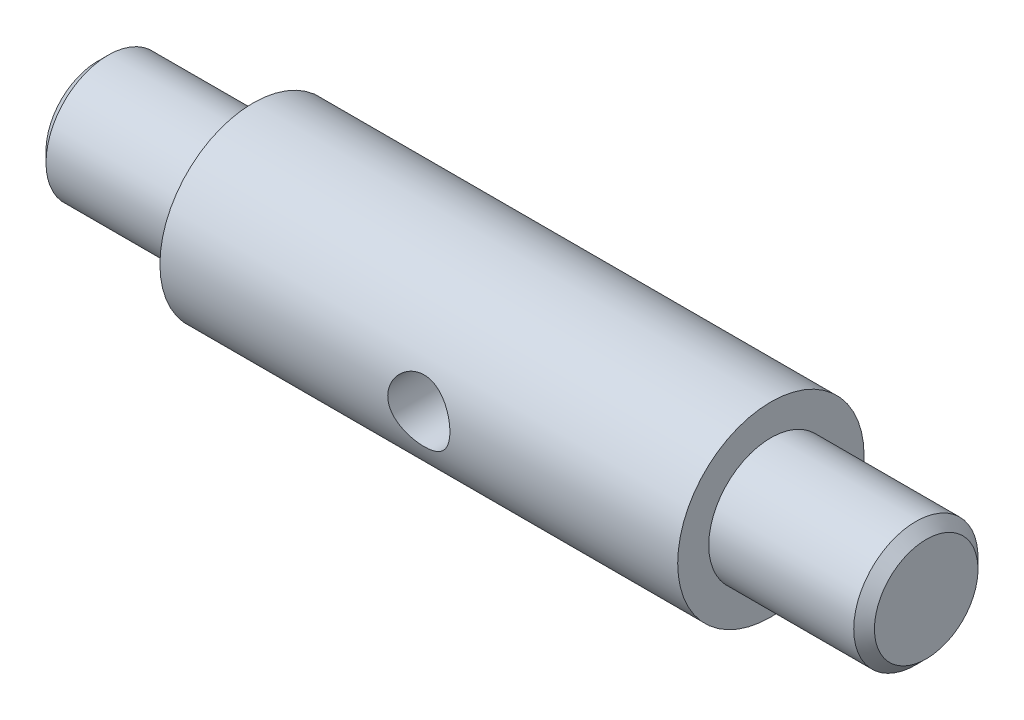
ISO-10303-21;
HEADER;
FILE_DESCRIPTION(('STEP AP214'),'2;1');
FILE_NAME('part.step','',(''),(''),'','','');
FILE_SCHEMA(('AUTOMOTIVE_DESIGN { 1 0 10303 214 1 1 1 1 }'));
ENDSEC;
DATA;
#1=APPLICATION_CONTEXT('core data for automotive mechanical design processes');
#2=APPLICATION_PROTOCOL_DEFINITION('international standard','automotive_design',2000,#1);
#3=PRODUCT_CONTEXT('',#1,'mechanical');
#4=PRODUCT('Part','Part','',(#3));
#5=PRODUCT_RELATED_PRODUCT_CATEGORY('part','',(#4));
#6=PRODUCT_DEFINITION_FORMATION('','',#4);
#7=PRODUCT_DEFINITION_CONTEXT('part definition',#1,'design');
#8=PRODUCT_DEFINITION('design','',#6,#7);
#9=PRODUCT_DEFINITION_SHAPE('','',#8);
#10=(LENGTH_UNIT() NAMED_UNIT(*) SI_UNIT(.MILLI.,.METRE.));
#11=(NAMED_UNIT(*) PLANE_ANGLE_UNIT() SI_UNIT($,.RADIAN.));
#12=(NAMED_UNIT(*) SI_UNIT($,.STERADIAN.) SOLID_ANGLE_UNIT());
#13=UNCERTAINTY_MEASURE_WITH_UNIT(LENGTH_MEASURE(1.E-05),#10,'distance_accuracy_value','');
#14=(GEOMETRIC_REPRESENTATION_CONTEXT(3) GLOBAL_UNCERTAINTY_ASSIGNED_CONTEXT((#13)) GLOBAL_UNIT_ASSIGNED_CONTEXT((#10,
#11,#12)) REPRESENTATION_CONTEXT('',''));
#15=CARTESIAN_POINT('',(0.,0.,0.));
#16=DIRECTION('',(0.,0.,1.));
#17=DIRECTION('',(1.,0.,0.));
#18=AXIS2_PLACEMENT_3D('',#15,#16,#17);
#19=CARTESIAN_POINT('',(40.,0.,-9.));
#20=DIRECTION('',(0.,0.,1.));
#21=DIRECTION('',(1.,0.,0.));
#22=AXIS2_PLACEMENT_3D('',#19,#20,#21);
#23=CYLINDRICAL_SURFACE('',#22,3.);
#24=CARTESIAN_POINT('',(43.,0.,9.));
#25=CARTESIAN_POINT('',(43.0000007611949,-0.163690088660169,9.00000045902832));
#26=CARTESIAN_POINT('',(42.9865592016184,-0.327375583615649,8.99549308522634));
#27=CARTESIAN_POINT('',(42.9333126735484,-0.649925282618916,8.97795630609842));
#28=CARTESIAN_POINT('',(42.8935049681532,-0.808788984356453,8.96492601606457));
#29=CARTESIAN_POINT('',(42.7890422698479,-1.11699836850533,8.93175923719327));
#30=CARTESIAN_POINT('',(42.7244288126222,-1.2663594776581,8.91163463192559));
#31=CARTESIAN_POINT('',(42.572376481485,-1.55212481041597,8.86633337152025));
#32=CARTESIAN_POINT('',(42.4849331049922,-1.68852647087612,8.84115572003333));
#33=CARTESIAN_POINT('',(42.2865225854237,-1.9492250250668,8.78742283329015));
#34=CARTESIAN_POINT('',(42.1749062972185,-2.07301110089493,8.75878669391354));
#35=CARTESIAN_POINT('',(41.9326985358803,-2.30049807810625,8.70180944349364));
#36=CARTESIAN_POINT('',(41.8021028952145,-2.40419455646839,8.67346839871647));
#37=CARTESIAN_POINT('',(41.5210446544106,-2.59147482668358,8.61939997431821));
#38=CARTESIAN_POINT('',(41.3701187808036,-2.67439457466309,8.59377117827064));
#39=CARTESIAN_POINT('',(41.0554717166244,-2.81345662163316,8.54925916255803));
#40=CARTESIAN_POINT('',(40.8917544485118,-2.8696070921603,8.53037388482236));
#41=CARTESIAN_POINT('',(40.5619803355099,-2.95162038452749,8.50233909808131));
#42=CARTESIAN_POINT('',(40.3961883745328,-2.97844034481531,8.49288287308833));
#43=CARTESIAN_POINT('',(40.0622087375324,-3.00402337000343,8.48386969888522));
#44=CARTESIAN_POINT('',(39.8940218178724,-3.00279510481416,8.48430969068189));
#45=CARTESIAN_POINT('',(39.5681901086679,-2.97305971111026,8.4947704502454));
#46=CARTESIAN_POINT('',(39.4104147912429,-2.94580173950099,8.50435247602598));
#47=CARTESIAN_POINT('',(39.1018197411795,-2.86681848854825,8.53129973173652));
#48=CARTESIAN_POINT('',(38.9510008436948,-2.81509027977562,8.54866589352322));
#49=CARTESIAN_POINT('',(38.6577617512256,-2.68781717418063,8.58953733393746));
#50=CARTESIAN_POINT('',(38.5155159235914,-2.61190214612179,8.61313697379351));
#51=CARTESIAN_POINT('',(38.2453872751608,-2.43866731890942,8.66377675727179));
#52=CARTESIAN_POINT('',(38.1175086191999,-2.34134133709202,8.6908178937139));
#53=CARTESIAN_POINT('',(37.8727252055177,-2.12204799804671,8.74701987503222));
#54=CARTESIAN_POINT('',(37.7567419164728,-1.99905945022894,8.77621768064528));
#55=CARTESIAN_POINT('',(37.5468062000098,-1.73501870991019,8.83220815161109));
#56=CARTESIAN_POINT('',(37.4528558855065,-1.59396478698245,8.85900058614201));
#57=CARTESIAN_POINT('',(37.2889110992948,-1.29584283913881,8.9075132381338));
#58=CARTESIAN_POINT('',(37.2191635259778,-1.13862982924901,8.92918050024117));
#59=CARTESIAN_POINT('',(37.1073904781329,-0.813807250093527,8.96461701433304));
#60=CARTESIAN_POINT('',(37.0653553737297,-0.646201314464865,8.97838900964637));
#61=CARTESIAN_POINT('',(37.0118330019329,-0.313151488587915,8.99602881214321));
#62=CARTESIAN_POINT('',(36.9991005724817,-0.147928799594541,9.00030005501183));
#63=CARTESIAN_POINT('',(37.0009980207954,0.182325209880711,8.99966708084482));
#64=CARTESIAN_POINT('',(37.0156232799396,0.34735655795895,8.99476441258086));
#65=CARTESIAN_POINT('',(37.0708357232079,0.667559598912766,8.97660074151312));
#66=CARTESIAN_POINT('',(37.1106586181485,0.822878420504531,8.96358596133576));
#67=CARTESIAN_POINT('',(37.2141803334002,1.12456787573872,8.93075540490209));
#68=CARTESIAN_POINT('',(37.2778821984034,1.27093736552582,8.91093876140025));
#69=CARTESIAN_POINT('',(37.4292112955224,1.55486488917982,8.86586793861869));
#70=CARTESIAN_POINT('',(37.5174237798495,1.69208987765144,8.84048444267358));
#71=CARTESIAN_POINT('',(37.7145824500404,1.95019449040676,8.78715761748787));
#72=CARTESIAN_POINT('',(37.8235349680953,2.07106910338673,8.75921350781482));
#73=CARTESIAN_POINT('',(38.0649362530198,2.2987575234189,8.70230543941334));
#74=CARTESIAN_POINT('',(38.1982276807806,2.40468290773731,8.67335283262283));
#75=CARTESIAN_POINT('',(38.4813147034327,2.59277256697072,8.61899919884126));
#76=CARTESIAN_POINT('',(38.6311104359022,2.67493664379304,8.59359820146006));
#77=CARTESIAN_POINT('',(38.9430190458697,2.81279079124908,8.5494717537415));
#78=CARTESIAN_POINT('',(39.1051062375063,2.86853439649506,8.53073282378936));
#79=CARTESIAN_POINT('',(39.4371359501324,2.95168400027807,8.50232496919348));
#80=CARTESIAN_POINT('',(39.607074896213,2.97910276486182,8.49265195870917));
#81=CARTESIAN_POINT('',(39.9405912881227,3.00382884743203,8.48393576622531));
#82=CARTESIAN_POINT('',(40.1040470208605,3.0026107719252,8.48437200772245));
#83=CARTESIAN_POINT('',(40.4282952247662,2.97372688034608,8.49453809471601));
#84=CARTESIAN_POINT('',(40.5890878538653,2.94606263837576,8.50426738708084));
#85=CARTESIAN_POINT('',(40.9004069890074,2.86611543938804,8.53153572914674));
#86=CARTESIAN_POINT('',(41.0510704750135,2.81431003804654,8.54892294067432));
#87=CARTESIAN_POINT('',(41.3416822208148,2.68793809727924,8.58949196455405));
#88=CARTESIAN_POINT('',(41.481628093564,2.61336650566142,8.61267506290179));
#89=CARTESIAN_POINT('',(41.7534510097687,2.43978207775029,8.66348487678138));
#90=CARTESIAN_POINT('',(41.8847095056952,2.33984472829374,8.69126134926411));
#91=CARTESIAN_POINT('',(42.1290694401526,2.11992864940694,8.74750068849758));
#92=CARTESIAN_POINT('',(42.2421657270642,1.99994425335444,8.77596374737116));
#93=CARTESIAN_POINT('',(42.4514332368675,1.73772467076207,8.83170091576632));
#94=CARTESIAN_POINT('',(42.546773043253,1.59480454049919,8.85888545403769));
#95=CARTESIAN_POINT('',(42.7119712865519,1.29407207221988,8.90777973517835));
#96=CARTESIAN_POINT('',(42.7818362377661,1.13626355439705,8.92949087723789));
#97=CARTESIAN_POINT('',(42.891164897466,0.817480941602932,8.96416545205625));
#98=CARTESIAN_POINT('',(42.9318473987901,0.656963273029229,8.97747637267567));
#99=CARTESIAN_POINT('',(42.9862608420314,0.330961248030742,8.99539221192665));
#100=CARTESIAN_POINT('',(42.9999992304896,0.16547827670624,8.99999953595714));
#101=CARTESIAN_POINT('',(43.,0.,9.));
#102=B_SPLINE_CURVE_WITH_KNOTS('',3,(#24,#25,#26,#27,#28,#29,#30,#31,#32,#33,#34,#35,#36,#37,
#38,#39,#40,#41,#42,#43,#44,#45,#46,#47,#48,#49,#50,#51,#52,#53,#54,#55,#56,#57,#58,#59,#60,#61,
#62,#63,#64,#65,#66,#67,#68,#69,#70,#71,#72,#73,#74,#75,#76,#77,#78,#79,#80,#81,#82,#83,#84,#85,
#86,#87,#88,#89,#90,#91,#92,#93,#94,#95,#96,#97,#98,#99,#100,#101),.UNSPECIFIED.,.T.,.F.,(4,2,2,
2,2,2,2,2,2,2,2,2,2,2,2,2,2,2,2,2,2,2,2,2,2,2,2,2,2,2,2,2,2,2,2,2,2,2,4),(0.,0.490461318078033,
0.980973555802562,1.47066801861082,1.9604591333973,2.46554052848268,2.97073299862591,
3.49045154470411,4.010011340785,4.51205777225521,5.01394901962457,5.49290479653841,
5.97191792566446,6.45864513465392,6.94551307674622,7.45779917434101,7.97013437899855,
8.48755216951072,9.00479006631625,9.49960749525509,9.9943413949253,10.4747447393464,
10.9552093585231,11.4483119953121,11.9415654246567,12.4572306864226,12.9729002470499,
13.4875204148031,14.0019085411752,14.4898699819277,14.9778023805413,15.4564676124125,
15.9352391452793,16.4349020007541,16.9347063337134,17.453989825053,17.9731404345737,
18.4690967512144,18.9649159811442),.UNSPECIFIED.);
#103=CARTESIAN_POINT('',(43.,0.,9.));
#104=VERTEX_POINT('',#103);
#105=EDGE_CURVE('E86',#104,#104,#102,.T.);
#106=ORIENTED_EDGE('',*,*,#105,.F.);
#107=EDGE_LOOP('',(#106));
#108=FACE_BOUND('',#107,.T.);
#109=CARTESIAN_POINT('',(40.,0.,0.));
#110=DIRECTION('',(0.707106781186547,0.,0.707106781186547));
#111=DIRECTION('',(-0.707106781186547,0.,0.707106781186547));
#112=AXIS2_PLACEMENT_3D('',#109,#110,#111);
#113=ELLIPSE('',#112,4.24264068711928,3.);
#114=CARTESIAN_POINT('',(40.,-3.,0.));
#115=VERTEX_POINT('',#114);
#116=CARTESIAN_POINT('',(40.,3.,0.));
#117=VERTEX_POINT('',#116);
#118=EDGE_CURVE('E49',#115,#117,#113,.F.);
#119=ORIENTED_EDGE('',*,*,#118,.T.);
#120=CARTESIAN_POINT('',(40.,0.,0.));
#121=DIRECTION('',(-0.707106781186547,0.,0.707106781186547));
#122=DIRECTION('',(0.707106781186547,0.,0.707106781186547));
#123=AXIS2_PLACEMENT_3D('',#120,#121,#122);
#124=ELLIPSE('',#123,4.24264068711928,3.);
#125=EDGE_CURVE('E11',#117,#115,#124,.F.);
#126=ORIENTED_EDGE('',*,*,#125,.T.);
#127=EDGE_LOOP('',(#119,#126));
#128=FACE_BOUND('',#127,.T.);
#129=ADVANCED_FACE('F35',(#108,#128),#23,.F.);
#130=CARTESIAN_POINT('',(0.,5.99999999999999,0.));
#131=DIRECTION('',(1.,0.,0.));
#132=DIRECTION('',(0.,0.,-1.));
#133=AXIS2_PLACEMENT_3D('',#130,#131,#132);
#134=PLANE('',#133);
#135=CARTESIAN_POINT('',(0.,0.,0.));
#136=DIRECTION('',(-1.,0.,0.));
#137=DIRECTION('',(0.,0.,1.));
#138=AXIS2_PLACEMENT_3D('',#135,#136,#137);
#139=CIRCLE('',#138,2.99999999999999);
#140=CARTESIAN_POINT('',(0.,0.,2.99999999999999));
#141=VERTEX_POINT('',#140);
#142=EDGE_CURVE('E70',#141,#141,#139,.T.);
#143=ORIENTED_EDGE('',*,*,#142,.F.);
#144=EDGE_LOOP('',(#143));
#145=FACE_BOUND('',#144,.T.);
#146=CARTESIAN_POINT('',(0.,0.,0.));
#147=DIRECTION('',(1.,0.,0.));
#148=DIRECTION('',(0.,0.,-1.));
#149=AXIS2_PLACEMENT_3D('',#146,#147,#148);
#150=CIRCLE('',#149,4.99999999999999);
#151=CARTESIAN_POINT('',(0.,0.,-4.99999999999999));
#152=VERTEX_POINT('',#151);
#153=EDGE_CURVE('E170',#152,#152,#150,.F.);
#154=ORIENTED_EDGE('',*,*,#153,.T.);
#155=EDGE_LOOP('',(#154));
#156=FACE_BOUND('',#155,.T.);
#157=ADVANCED_FACE('F125',(#145,#156),#134,.F.);
#158=CARTESIAN_POINT('',(80.,0.,0.));
#159=DIRECTION('',(-1.,0.,0.));
#160=DIRECTION('',(0.,0.,1.));
#161=AXIS2_PLACEMENT_3D('',#158,#159,#160);
#162=PLANE('',#161);
#163=CARTESIAN_POINT('',(80.,0.,0.));
#164=DIRECTION('',(-1.,0.,0.));
#165=DIRECTION('',(0.,0.,1.));
#166=AXIS2_PLACEMENT_3D('',#163,#164,#165);
#167=CIRCLE('',#166,5.00000000000002);
#168=CARTESIAN_POINT('',(80.,0.,5.00000000000002));
#169=VERTEX_POINT('',#168);
#170=EDGE_CURVE('E167',#169,#169,#167,.F.);
#171=ORIENTED_EDGE('',*,*,#170,.T.);
#172=EDGE_LOOP('',(#171));
#173=FACE_BOUND('',#172,.T.);
#174=ADVANCED_FACE('F130',(#173),#162,.F.);
#175=CARTESIAN_POINT('',(0.,0.,0.));
#176=DIRECTION('',(-1.,0.,0.));
#177=DIRECTION('',(0.,0.,1.));
#178=AXIS2_PLACEMENT_3D('',#175,#176,#177);
#179=CYLINDRICAL_SURFACE('',#178,6.);
#180=CARTESIAN_POINT('',(79.,0.,0.));
#181=DIRECTION('',(-1.,0.,0.));
#182=DIRECTION('',(0.,0.,1.));
#183=AXIS2_PLACEMENT_3D('',#180,#181,#182);
#184=CIRCLE('',#183,6.);
#185=CARTESIAN_POINT('',(79.,0.,6.));
#186=VERTEX_POINT('',#185);
#187=EDGE_CURVE('E169',#186,#186,#184,.T.);
#188=ORIENTED_EDGE('',*,*,#187,.T.);
#189=EDGE_LOOP('',(#188));
#190=FACE_BOUND('',#189,.T.);
#191=CARTESIAN_POINT('',(65.,0.,0.));
#192=DIRECTION('',(-1.,0.,0.));
#193=DIRECTION('',(0.,0.,1.));
#194=AXIS2_PLACEMENT_3D('',#191,#192,#193);
#195=CIRCLE('',#194,6.);
#196=CARTESIAN_POINT('',(65.,0.,6.));
#197=VERTEX_POINT('',#196);
#198=EDGE_CURVE('E83',#197,#197,#195,.T.);
#199=ORIENTED_EDGE('',*,*,#198,.F.);
#200=EDGE_LOOP('',(#199));
#201=FACE_BOUND('',#200,.T.);
#202=ADVANCED_FACE('F142',(#190,#201),#179,.T.);
#203=CARTESIAN_POINT('',(65.,6.,0.));
#204=DIRECTION('',(-1.,0.,0.));
#205=DIRECTION('',(0.,0.,1.));
#206=AXIS2_PLACEMENT_3D('',#203,#204,#205);
#207=PLANE('',#206);
#208=CARTESIAN_POINT('',(65.,0.,0.));
#209=DIRECTION('',(-1.,0.,0.));
#210=DIRECTION('',(0.,0.,1.));
#211=AXIS2_PLACEMENT_3D('',#208,#209,#210);
#212=CIRCLE('',#211,9.);
#213=CARTESIAN_POINT('',(65.,0.,9.));
#214=VERTEX_POINT('',#213);
#215=EDGE_CURVE('E80',#214,#214,#212,.T.);
#216=ORIENTED_EDGE('',*,*,#215,.F.);
#217=EDGE_LOOP('',(#216));
#218=FACE_BOUND('',#217,.T.);
#219=ORIENTED_EDGE('',*,*,#198,.T.);
#220=EDGE_LOOP('',(#219));
#221=FACE_BOUND('',#220,.T.);
#222=ADVANCED_FACE('F120',(#218,#221),#207,.F.);
#223=CARTESIAN_POINT('',(0.,0.,0.));
#224=DIRECTION('',(-1.,0.,0.));
#225=DIRECTION('',(0.,0.,1.));
#226=AXIS2_PLACEMENT_3D('',#223,#224,#225);
#227=CYLINDRICAL_SURFACE('',#226,8.99999999999999);
#228=CARTESIAN_POINT('',(43.,0.,-8.99999999999999));
#229=CARTESIAN_POINT('',(43.0000007611949,0.16369008866017,-9.00000045902832));
#230=CARTESIAN_POINT('',(42.9865592016184,0.32737558361565,-8.99549308522634));
#231=CARTESIAN_POINT('',(42.9333126735484,0.649925282618917,-8.97795630609842));
#232=CARTESIAN_POINT('',(42.8935049681532,0.808788984356454,-8.96492601606457));
#233=CARTESIAN_POINT('',(42.7890422698479,1.11699836850533,-8.93175923719327));
#234=CARTESIAN_POINT('',(42.7244288126222,1.2663594776581,-8.91163463192559));
#235=CARTESIAN_POINT('',(42.572376481485,1.55212481041597,-8.86633337152025));
#236=CARTESIAN_POINT('',(42.4849331049922,1.68852647087612,-8.84115572003333));
#237=CARTESIAN_POINT('',(42.2865225854237,1.9492250250668,-8.78742283329015));
#238=CARTESIAN_POINT('',(42.1749062972185,2.07301110089493,-8.75878669391354));
#239=CARTESIAN_POINT('',(41.9326985358803,2.30049807810625,-8.70180944349364));
#240=CARTESIAN_POINT('',(41.8021028952145,2.40419455646839,-8.67346839871647));
#241=CARTESIAN_POINT('',(41.5210446544106,2.59147482668358,-8.61939997431821));
#242=CARTESIAN_POINT('',(41.3701187808036,2.6743945746631,-8.59377117827064));
#243=CARTESIAN_POINT('',(41.0554717166244,2.81345662163316,-8.54925916255803));
#244=CARTESIAN_POINT('',(40.8917544485118,2.86960709216029,-8.53037388482236));
#245=CARTESIAN_POINT('',(40.5619803355099,2.95162038452749,-8.50233909808131));
#246=CARTESIAN_POINT('',(40.3961883745328,2.97844034481531,-8.49288287308833));
#247=CARTESIAN_POINT('',(40.0622087375324,3.00402337000343,-8.48386969888522));
#248=CARTESIAN_POINT('',(39.8940218178724,3.00279510481416,-8.48430969068189));
#249=CARTESIAN_POINT('',(39.5681901086679,2.97305971111026,-8.4947704502454));
#250=CARTESIAN_POINT('',(39.4104147912429,2.94580173950099,-8.50435247602598));
#251=CARTESIAN_POINT('',(39.1018197411795,2.86681848854825,-8.53129973173652));
#252=CARTESIAN_POINT('',(38.9510008436948,2.81509027977561,-8.54866589352322));
#253=CARTESIAN_POINT('',(38.6577617512256,2.68781717418063,-8.58953733393746));
#254=CARTESIAN_POINT('',(38.5155159235914,2.61190214612179,-8.61313697379351));
#255=CARTESIAN_POINT('',(38.2453872751608,2.43866731890942,-8.66377675727179));
#256=CARTESIAN_POINT('',(38.1175086191999,2.34134133709201,-8.6908178937139));
#257=CARTESIAN_POINT('',(37.8727252055177,2.12204799804671,-8.74701987503222));
#258=CARTESIAN_POINT('',(37.7567419164728,1.99905945022894,-8.77621768064528));
#259=CARTESIAN_POINT('',(37.5468062000098,1.73501870991019,-8.83220815161109));
#260=CARTESIAN_POINT('',(37.4528558855065,1.59396478698244,-8.85900058614201));
#261=CARTESIAN_POINT('',(37.2889110992948,1.2958428391388,-8.9075132381338));
#262=CARTESIAN_POINT('',(37.2191635259778,1.13862982924901,-8.92918050024117));
#263=CARTESIAN_POINT('',(37.1073904781329,0.813807250093524,-8.96461701433304));
#264=CARTESIAN_POINT('',(37.0653553737297,0.646201314464861,-8.97838900964637));
#265=CARTESIAN_POINT('',(37.0118330019329,0.313151488587912,-8.99602881214321));
#266=CARTESIAN_POINT('',(36.9991005724817,0.147928799594538,-9.00030005501184));
#267=CARTESIAN_POINT('',(37.0009980207954,-0.182325209880713,-8.99966708084482));
#268=CARTESIAN_POINT('',(37.0156232799396,-0.347356557958953,-8.99476441258086));
#269=CARTESIAN_POINT('',(37.0708357232079,-0.667559598912768,-8.97660074151312));
#270=CARTESIAN_POINT('',(37.1106586181485,-0.822878420504532,-8.96358596133576));
#271=CARTESIAN_POINT('',(37.2141803334002,-1.12456787573872,-8.93075540490209));
#272=CARTESIAN_POINT('',(37.2778821984034,-1.27093736552582,-8.91093876140025));
#273=CARTESIAN_POINT('',(37.4292112955224,-1.55486488917982,-8.86586793861869));
#274=CARTESIAN_POINT('',(37.5174237798495,-1.69208987765144,-8.84048444267358));
#275=CARTESIAN_POINT('',(37.7145824500405,-1.95019449040676,-8.78715761748787));
#276=CARTESIAN_POINT('',(37.8235349680953,-2.07106910338673,-8.75921350781482));
#277=CARTESIAN_POINT('',(38.0649362530198,-2.2987575234189,-8.70230543941334));
#278=CARTESIAN_POINT('',(38.1982276807806,-2.40468290773731,-8.67335283262283));
#279=CARTESIAN_POINT('',(38.4813147034327,-2.59277256697072,-8.61899919884126));
#280=CARTESIAN_POINT('',(38.6311104359022,-2.67493664379304,-8.59359820146006));
#281=CARTESIAN_POINT('',(38.9430190458697,-2.81279079124909,-8.5494717537415));
#282=CARTESIAN_POINT('',(39.1051062375063,-2.86853439649507,-8.53073282378936));
#283=CARTESIAN_POINT('',(39.4371359501324,-2.95168400027807,-8.50232496919348));
#284=CARTESIAN_POINT('',(39.607074896213,-2.97910276486182,-8.49265195870917));
#285=CARTESIAN_POINT('',(39.9405912881227,-3.00382884743203,-8.48393576622531));
#286=CARTESIAN_POINT('',(40.1040470208605,-3.0026107719252,-8.48437200772245));
#287=CARTESIAN_POINT('',(40.4282952247662,-2.97372688034608,-8.49453809471601));
#288=CARTESIAN_POINT('',(40.5890878538653,-2.94606263837576,-8.50426738708084));
#289=CARTESIAN_POINT('',(40.9004069890074,-2.86611543938804,-8.53153572914674));
#290=CARTESIAN_POINT('',(41.0510704750135,-2.81431003804654,-8.54892294067432));
#291=CARTESIAN_POINT('',(41.3416822208148,-2.68793809727924,-8.58949196455405));
#292=CARTESIAN_POINT('',(41.481628093564,-2.61336650566142,-8.61267506290179));
#293=CARTESIAN_POINT('',(41.7534510097687,-2.43978207775029,-8.66348487678138));
#294=CARTESIAN_POINT('',(41.8847095056952,-2.33984472829374,-8.69126134926411));
#295=CARTESIAN_POINT('',(42.1290694401526,-2.11992864940694,-8.74750068849758));
#296=CARTESIAN_POINT('',(42.2421657270642,-1.99994425335444,-8.77596374737116));
#297=CARTESIAN_POINT('',(42.4514332368675,-1.73772467076206,-8.83170091576632));
#298=CARTESIAN_POINT('',(42.546773043253,-1.59480454049918,-8.85888545403769));
#299=CARTESIAN_POINT('',(42.711971286552,-1.29407207221987,-8.90777973517836));
#300=CARTESIAN_POINT('',(42.7818362377661,-1.13626355439704,-8.92949087723789));
#301=CARTESIAN_POINT('',(42.891164897466,-0.817480941602925,-8.96416545205625));
#302=CARTESIAN_POINT('',(42.9318473987901,-0.656963273029223,-8.97747637267567));
#303=CARTESIAN_POINT('',(42.9862608420314,-0.330961248030739,-8.99539221192665));
#304=CARTESIAN_POINT('',(42.9999992304896,-0.165478276706238,-8.99999953595714));
#305=CARTESIAN_POINT('',(43.,0.,-8.99999999999999));
#306=B_SPLINE_CURVE_WITH_KNOTS('',3,(#228,#229,#230,#231,#232,#233,#234,#235,#236,#237,#238,
#239,#240,#241,#242,#243,#244,#245,#246,#247,#248,#249,#250,#251,#252,#253,#254,#255,#256,#257,
#258,#259,#260,#261,#262,#263,#264,#265,#266,#267,#268,#269,#270,#271,#272,#273,#274,#275,#276,
#277,#278,#279,#280,#281,#282,#283,#284,#285,#286,#287,#288,#289,#290,#291,#292,#293,#294,#295,
#296,#297,#298,#299,#300,#301,#302,#303,#304,#305),.UNSPECIFIED.,.T.,.F.,(4,2,2,2,2,2,2,2,2,2,2,
2,2,2,2,2,2,2,2,2,2,2,2,2,2,2,2,2,2,2,2,2,2,2,2,2,2,2,4),(0.,0.490461318078033,
0.980973555802562,1.47066801861082,1.9604591333973,2.46554052848268,2.97073299862591,
3.49045154470411,4.010011340785,4.5120577722552,5.01394901962457,5.49290479653841,
5.97191792566446,6.45864513465392,6.94551307674622,7.45779917434101,7.97013437899855,
8.48755216951073,9.00479006631625,9.49960749525509,9.9943413949253,10.4747447393464,
10.9552093585231,11.4483119953121,11.9415654246567,12.4572306864226,12.9729002470499,
13.4875204148031,14.0019085411752,14.4898699819277,14.9778023805413,15.4564676124125,
15.9352391452793,16.4349020007541,16.9347063337134,17.453989825053,17.9731404345737,
18.4690967512144,18.9649159811442),.UNSPECIFIED.);
#307=CARTESIAN_POINT('',(43.,0.,-8.99999999999999));
#308=VERTEX_POINT('',#307);
#309=EDGE_CURVE('E94',#308,#308,#306,.T.);
#310=ORIENTED_EDGE('',*,*,#309,.T.);
#311=EDGE_LOOP('',(#310));
#312=FACE_BOUND('',#311,.T.);
#313=ORIENTED_EDGE('',*,*,#105,.T.);
#314=EDGE_LOOP('',(#313));
#315=FACE_BOUND('',#314,.T.);
#316=CARTESIAN_POINT('',(15.,0.,0.));
#317=DIRECTION('',(-1.,0.,0.));
#318=DIRECTION('',(0.,0.,1.));
#319=AXIS2_PLACEMENT_3D('',#316,#317,#318);
#320=CIRCLE('',#319,8.99999999999999);
#321=CARTESIAN_POINT('',(15.,0.,8.99999999999999));
#322=VERTEX_POINT('',#321);
#323=EDGE_CURVE('E73',#322,#322,#320,.T.);
#324=ORIENTED_EDGE('',*,*,#323,.F.);
#325=EDGE_LOOP('',(#324));
#326=FACE_BOUND('',#325,.T.);
#327=ORIENTED_EDGE('',*,*,#215,.T.);
#328=EDGE_LOOP('',(#327));
#329=FACE_BOUND('',#328,.T.);
#330=ADVANCED_FACE('F99',(#312,#315,#326,#329),#227,.T.);
#331=CARTESIAN_POINT('',(15.,8.99999999999999,0.));
#332=DIRECTION('',(1.,0.,0.));
#333=DIRECTION('',(0.,0.,-1.));
#334=AXIS2_PLACEMENT_3D('',#331,#332,#333);
#335=PLANE('',#334);
#336=CARTESIAN_POINT('',(15.,0.,0.));
#337=DIRECTION('',(-1.,0.,0.));
#338=DIRECTION('',(0.,0.,1.));
#339=AXIS2_PLACEMENT_3D('',#336,#337,#338);
#340=CIRCLE('',#339,5.99999999999999);
#341=CARTESIAN_POINT('',(15.,0.,5.99999999999999));
#342=VERTEX_POINT('',#341);
#343=EDGE_CURVE('E69',#342,#342,#340,.T.);
#344=ORIENTED_EDGE('',*,*,#343,.F.);
#345=EDGE_LOOP('',(#344));
#346=FACE_BOUND('',#345,.T.);
#347=ORIENTED_EDGE('',*,*,#323,.T.);
#348=EDGE_LOOP('',(#347));
#349=FACE_BOUND('',#348,.T.);
#350=ADVANCED_FACE('F113',(#346,#349),#335,.F.);
#351=CARTESIAN_POINT('',(0.,0.,0.));
#352=DIRECTION('',(-1.,0.,0.));
#353=DIRECTION('',(0.,0.,1.));
#354=AXIS2_PLACEMENT_3D('',#351,#352,#353);
#355=CYLINDRICAL_SURFACE('',#354,5.99999999999999);
#356=CARTESIAN_POINT('',(1.00000000000001,0.,0.));
#357=DIRECTION('',(1.,0.,0.));
#358=DIRECTION('',(0.,0.,-1.));
#359=AXIS2_PLACEMENT_3D('',#356,#357,#358);
#360=CIRCLE('',#359,5.99999999999999);
#361=CARTESIAN_POINT('',(1.00000000000001,0.,-5.99999999999999));
#362=VERTEX_POINT('',#361);
#363=EDGE_CURVE('E176',#362,#362,#360,.T.);
#364=ORIENTED_EDGE('',*,*,#363,.T.);
#365=EDGE_LOOP('',(#364));
#366=FACE_BOUND('',#365,.T.);
#367=ORIENTED_EDGE('',*,*,#343,.T.);
#368=EDGE_LOOP('',(#367));
#369=FACE_BOUND('',#368,.T.);
#370=ADVANCED_FACE('F108',(#366,#369),#355,.T.);
#371=CARTESIAN_POINT('',(40.,0.,0.));
#372=DIRECTION('',(0.707106781186547,0.,0.707106781186547));
#373=DIRECTION('',(-0.707106781186547,0.,0.707106781186547));
#374=AXIS2_PLACEMENT_3D('',#371,#372,#373);
#375=ELLIPSE('',#374,4.24264068711928,3.);
#376=EDGE_CURVE('E56',#115,#117,#375,.T.);
#377=ORIENTED_EDGE('',*,*,#376,.T.);
#378=CARTESIAN_POINT('',(40.,0.,0.));
#379=DIRECTION('',(-0.707106781186547,0.,0.707106781186547));
#380=DIRECTION('',(0.707106781186547,0.,0.707106781186547));
#381=AXIS2_PLACEMENT_3D('',#378,#379,#380);
#382=ELLIPSE('',#381,4.24264068711928,3.);
#383=EDGE_CURVE('E44',#117,#115,#382,.T.);
#384=ORIENTED_EDGE('',*,*,#383,.T.);
#385=EDGE_LOOP('',(#377,#384));
#386=FACE_BOUND('',#385,.T.);
#387=ORIENTED_EDGE('',*,*,#309,.F.);
#388=EDGE_LOOP('',(#387));
#389=FACE_BOUND('',#388,.T.);
#390=ADVANCED_FACE('F103',(#386,#389),#23,.F.);
#391=CARTESIAN_POINT('',(79.,0.,0.));
#392=DIRECTION('',(-1.,0.,0.));
#393=DIRECTION('',(0.,0.,1.));
#394=AXIS2_PLACEMENT_3D('',#391,#392,#393);
#395=CONICAL_SURFACE('',#394,6.,0.78539816339745);
#396=ORIENTED_EDGE('',*,*,#170,.F.);
#397=EDGE_LOOP('',(#396));
#398=FACE_BOUND('',#397,.T.);
#399=ORIENTED_EDGE('',*,*,#187,.F.);
#400=EDGE_LOOP('',(#399));
#401=FACE_BOUND('',#400,.T.);
#402=ADVANCED_FACE('F107',(#398,#401),#395,.T.);
#403=CARTESIAN_POINT('',(0.,0.,0.));
#404=DIRECTION('',(1.,0.,0.));
#405=DIRECTION('',(0.,0.,-1.));
#406=AXIS2_PLACEMENT_3D('',#403,#404,#405);
#407=CONICAL_SURFACE('',#406,4.99999999999999,0.785398163397445);
#408=ORIENTED_EDGE('',*,*,#363,.F.);
#409=EDGE_LOOP('',(#408));
#410=FACE_BOUND('',#409,.T.);
#411=ORIENTED_EDGE('',*,*,#153,.F.);
#412=EDGE_LOOP('',(#411));
#413=FACE_BOUND('',#412,.T.);
#414=ADVANCED_FACE('F38',(#410,#413),#407,.T.);
#415=CARTESIAN_POINT('',(0.,0.,0.));
#416=DIRECTION('',(-1.,0.,0.));
#417=DIRECTION('',(0.,0.,1.));
#418=AXIS2_PLACEMENT_3D('',#415,#416,#417);
#419=CYLINDRICAL_SURFACE('',#418,2.99999999999999);
#420=ORIENTED_EDGE('',*,*,#142,.T.);
#421=EDGE_LOOP('',(#420));
#422=FACE_BOUND('',#421,.T.);
#423=ORIENTED_EDGE('',*,*,#118,.F.);
#424=ORIENTED_EDGE('',*,*,#383,.F.);
#425=EDGE_LOOP('',(#423,#424));
#426=FACE_BOUND('',#425,.T.);
#427=ADVANCED_FACE('F162',(#422,#426),#419,.F.);
#428=CARTESIAN_POINT('',(45.,0.,0.));
#429=DIRECTION('',(-1.,0.,0.));
#430=DIRECTION('',(0.,0.,1.));
#431=AXIS2_PLACEMENT_3D('',#428,#429,#430);
#432=CIRCLE('',#431,2.99999999999999);
#433=CARTESIAN_POINT('',(45.,0.,2.99999999999999));
#434=VERTEX_POINT('',#433);
#435=EDGE_CURVE('E67',#434,#434,#432,.T.);
#436=ORIENTED_EDGE('',*,*,#435,.F.);
#437=EDGE_LOOP('',(#436));
#438=FACE_BOUND('',#437,.T.);
#439=ORIENTED_EDGE('',*,*,#376,.F.);
#440=ORIENTED_EDGE('',*,*,#125,.F.);
#441=EDGE_LOOP('',(#439,#440));
#442=FACE_BOUND('',#441,.T.);
#443=ADVANCED_FACE('F63',(#438,#442),#419,.F.);
#444=CARTESIAN_POINT('',(45.,0.,0.));
#445=DIRECTION('',(-1.,0.,0.));
#446=DIRECTION('',(0.,0.,1.));
#447=AXIS2_PLACEMENT_3D('',#444,#445,#446);
#448=CONICAL_SURFACE('',#447,2.99999999999999,1.02974425867665);
#449=CARTESIAN_POINT('',(46.8025818570827,0.,0.));
#450=VERTEX_POINT('',#449);
#451=VERTEX_LOOP('',#450);
#452=FACE_BOUND('',#451,.T.);
#453=ORIENTED_EDGE('',*,*,#435,.T.);
#454=EDGE_LOOP('',(#453));
#455=FACE_BOUND('',#454,.T.);
#456=ADVANCED_FACE('F60',(#452,#455),#448,.F.);
#457=CLOSED_SHELL('',(#129,#157,#174,#202,#222,#330,#350,#370,#390,#402,#414,#427,#443,#456));
#458=MANIFOLD_SOLID_BREP('B2',#457);
#459=ADVANCED_BREP_SHAPE_REPRESENTATION('',(#18,#458),#14);
#460=SHAPE_DEFINITION_REPRESENTATION(#9,#459);
ENDSEC;
END-ISO-10303-21;
